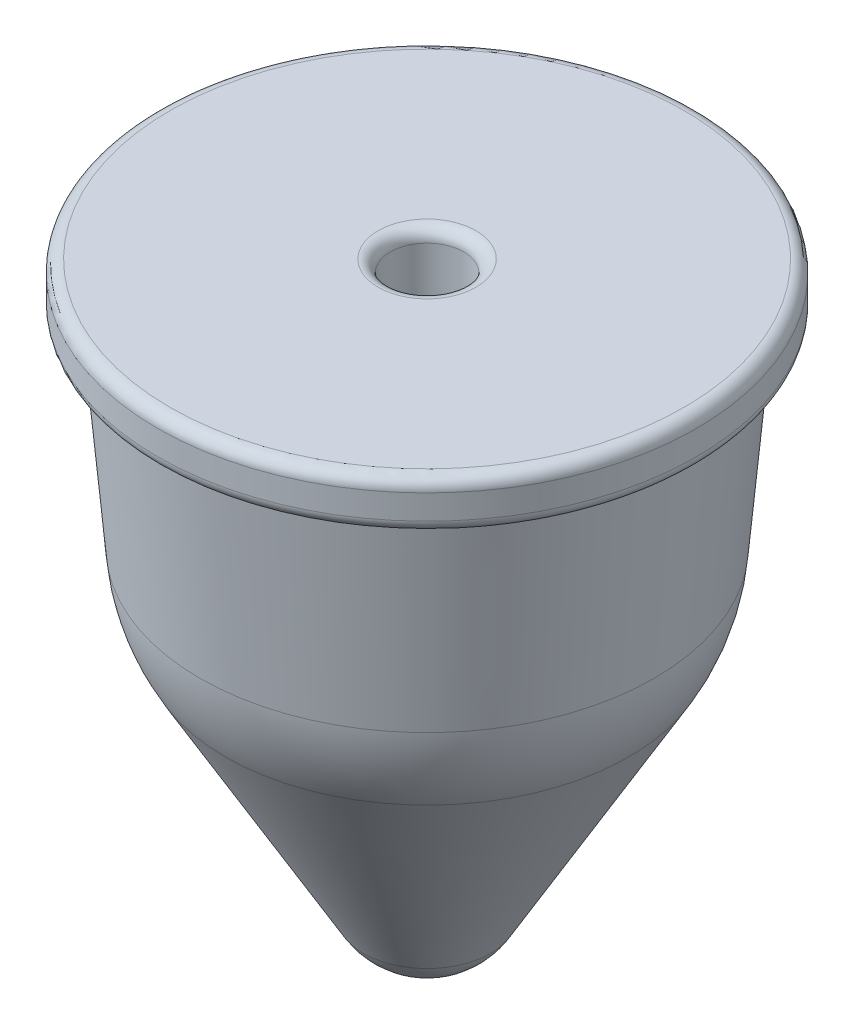
ISO-10303-21;
HEADER;
FILE_DESCRIPTION(('STEP AP214'),'2;1');
FILE_NAME('part.step','',(''),(''),'','','');
FILE_SCHEMA(('AUTOMOTIVE_DESIGN { 1 0 10303 214 1 1 1 1 }'));
ENDSEC;
DATA;
#1=APPLICATION_CONTEXT('core data for automotive mechanical design processes');
#2=APPLICATION_PROTOCOL_DEFINITION('international standard','automotive_design',2000,#1);
#3=PRODUCT_CONTEXT('',#1,'mechanical');
#4=PRODUCT('Part','Part','',(#3));
#5=PRODUCT_RELATED_PRODUCT_CATEGORY('part','',(#4));
#6=PRODUCT_DEFINITION_FORMATION('','',#4);
#7=PRODUCT_DEFINITION_CONTEXT('part definition',#1,'design');
#8=PRODUCT_DEFINITION('design','',#6,#7);
#9=PRODUCT_DEFINITION_SHAPE('','',#8);
#10=(LENGTH_UNIT() NAMED_UNIT(*) SI_UNIT(.MILLI.,.METRE.));
#11=(NAMED_UNIT(*) PLANE_ANGLE_UNIT() SI_UNIT($,.RADIAN.));
#12=(NAMED_UNIT(*) SI_UNIT($,.STERADIAN.) SOLID_ANGLE_UNIT());
#13=UNCERTAINTY_MEASURE_WITH_UNIT(LENGTH_MEASURE(1.E-05),#10,'distance_accuracy_value','');
#14=(GEOMETRIC_REPRESENTATION_CONTEXT(3) GLOBAL_UNCERTAINTY_ASSIGNED_CONTEXT((#13)) GLOBAL_UNIT_ASSIGNED_CONTEXT((#10,
#11,#12)) REPRESENTATION_CONTEXT('',''));
#15=CARTESIAN_POINT('',(0.,0.,0.));
#16=DIRECTION('',(0.,0.,1.));
#17=DIRECTION('',(1.,0.,0.));
#18=AXIS2_PLACEMENT_3D('',#15,#16,#17);
#19=CARTESIAN_POINT('',(0.,31.9265368447579,0.));
#20=DIRECTION('',(0.,-1.,0.));
#21=DIRECTION('',(-1.,0.,0.));
#22=AXIS2_PLACEMENT_3D('',#19,#20,#21);
#23=SPHERICAL_SURFACE('',#22,3.);
#24=CARTESIAN_POINT('',(0.,30.4265368447579,0.));
#25=DIRECTION('',(0.,-1.,0.));
#26=DIRECTION('',(0.,0.,-1.));
#27=AXIS2_PLACEMENT_3D('',#24,#25,#26);
#28=CIRCLE('',#27,2.59807621135332);
#29=CARTESIAN_POINT('',(0.,30.4265368447579,2.59807621135332));
#30=VERTEX_POINT('',#29);
#31=EDGE_CURVE('E135',#30,#30,#28,.T.);
#32=ORIENTED_EDGE('',*,*,#31,.T.);
#33=EDGE_LOOP('',(#32));
#34=FACE_BOUND('',#33,.T.);
#35=ADVANCED_FACE('F50',(#34),#23,.T.);
#36=CARTESIAN_POINT('',(0.,53.6927940025591,0.));
#37=DIRECTION('',(0.,1.,0.));
#38=DIRECTION('',(0.,0.,1.));
#39=AXIS2_PLACEMENT_3D('',#36,#37,#38);
#40=PLANE('',#39);
#41=CARTESIAN_POINT('',(0.,53.6927940025591,0.));
#42=DIRECTION('',(0.,1.,0.));
#43=DIRECTION('',(0.,0.,1.));
#44=AXIS2_PLACEMENT_3D('',#41,#42,#43);
#45=CIRCLE('',#44,2.);
#46=CARTESIAN_POINT('',(0.,53.6927940025591,2.));
#47=VERTEX_POINT('',#46);
#48=EDGE_CURVE('E11',#47,#47,#45,.F.);
#49=ORIENTED_EDGE('',*,*,#48,.T.);
#50=EDGE_LOOP('',(#49));
#51=FACE_BOUND('',#50,.T.);
#52=CARTESIAN_POINT('',(0.,53.6927940025591,0.));
#53=DIRECTION('',(0.,1.,0.));
#54=DIRECTION('',(0.,0.,1.));
#55=AXIS2_PLACEMENT_3D('',#52,#53,#54);
#56=CIRCLE('',#55,10.5);
#57=CARTESIAN_POINT('',(0.,53.6927940025591,10.5));
#58=VERTEX_POINT('',#57);
#59=EDGE_CURVE('E113',#58,#58,#56,.T.);
#60=ORIENTED_EDGE('',*,*,#59,.T.);
#61=EDGE_LOOP('',(#60));
#62=FACE_BOUND('',#61,.T.);
#63=ADVANCED_FACE('F76',(#51,#62),#40,.T.);
#64=CARTESIAN_POINT('',(0.,0.,0.));
#65=DIRECTION('',(0.,-1.,0.));
#66=DIRECTION('',(0.,0.,-1.));
#67=AXIS2_PLACEMENT_3D('',#64,#65,#66);
#68=CYLINDRICAL_SURFACE('',#67,11.);
#69=CARTESIAN_POINT('',(0.,52.1927940025591,0.));
#70=DIRECTION('',(0.,1.,0.));
#71=DIRECTION('',(0.,0.,1.));
#72=AXIS2_PLACEMENT_3D('',#69,#70,#71);
#73=CIRCLE('',#72,11.);
#74=CARTESIAN_POINT('',(0.,52.1927940025591,11.));
#75=VERTEX_POINT('',#74);
#76=EDGE_CURVE('E122',#75,#75,#73,.T.);
#77=ORIENTED_EDGE('',*,*,#76,.T.);
#78=EDGE_LOOP('',(#77));
#79=FACE_BOUND('',#78,.T.);
#80=CARTESIAN_POINT('',(0.,53.1927940025591,0.));
#81=DIRECTION('',(0.,1.,0.));
#82=DIRECTION('',(0.,0.,1.));
#83=AXIS2_PLACEMENT_3D('',#80,#81,#82);
#84=CIRCLE('',#83,11.);
#85=CARTESIAN_POINT('',(0.,53.1927940025591,11.));
#86=VERTEX_POINT('',#85);
#87=EDGE_CURVE('E139',#86,#86,#84,.F.);
#88=ORIENTED_EDGE('',*,*,#87,.T.);
#89=EDGE_LOOP('',(#88));
#90=FACE_BOUND('',#89,.T.);
#91=ADVANCED_FACE('F82',(#79,#90),#68,.T.);
#92=CARTESIAN_POINT('',(0.,51.6927940025591,0.));
#93=DIRECTION('',(0.,1.,0.));
#94=DIRECTION('',(0.,0.,1.));
#95=AXIS2_PLACEMENT_3D('',#92,#93,#94);
#96=PLANE('',#95);
#97=CARTESIAN_POINT('',(0.,51.6927940025591,0.));
#98=DIRECTION('',(0.,1.,0.));
#99=DIRECTION('',(0.,0.,1.));
#100=AXIS2_PLACEMENT_3D('',#97,#98,#99);
#101=CIRCLE('',#100,10.4543457494654);
#102=CARTESIAN_POINT('',(0.,51.6927940025591,10.4543457494654));
#103=VERTEX_POINT('',#102);
#104=EDGE_CURVE('E107',#103,#103,#101,.T.);
#105=ORIENTED_EDGE('',*,*,#104,.T.);
#106=EDGE_LOOP('',(#105));
#107=FACE_BOUND('',#106,.T.);
#108=CARTESIAN_POINT('',(0.,51.6927940025591,0.));
#109=DIRECTION('',(0.,1.,0.));
#110=DIRECTION('',(0.,0.,1.));
#111=AXIS2_PLACEMENT_3D('',#108,#109,#110);
#112=CIRCLE('',#111,10.5);
#113=CARTESIAN_POINT('',(0.,51.6927940025591,10.5));
#114=VERTEX_POINT('',#113);
#115=EDGE_CURVE('E136',#114,#114,#112,.F.);
#116=ORIENTED_EDGE('',*,*,#115,.T.);
#117=EDGE_LOOP('',(#116));
#118=FACE_BOUND('',#117,.T.);
#119=ADVANCED_FACE('F158',(#107,#118),#96,.F.);
#120=CARTESIAN_POINT('',(0.,51.6927940025591,0.));
#121=DIRECTION('',(0.,1.,0.));
#122=DIRECTION('',(0.,0.,1.));
#123=AXIS2_PLACEMENT_3D('',#120,#121,#122);
#124=CONICAL_SURFACE('',#123,9.99618016245665,0.08726646259971);
#125=CARTESIAN_POINT('',(0.,51.236371873933,0.));
#126=DIRECTION('',(0.,1.,0.));
#127=DIRECTION('',(0.,0.,1.));
#128=AXIS2_PLACEMENT_3D('',#125,#126,#127);
#129=CIRCLE('',#128,9.9562484004195);
#130=CARTESIAN_POINT('',(0.,51.236371873933,9.9562484004195));
#131=VERTEX_POINT('',#130);
#132=EDGE_CURVE('E110',#131,#131,#129,.F.);
#133=ORIENTED_EDGE('',*,*,#132,.T.);
#134=EDGE_LOOP('',(#133));
#135=FACE_BOUND('',#134,.T.);
#136=CARTESIAN_POINT('',(0.,43.4976554018028,0.));
#137=DIRECTION('',(0.,-1.,0.));
#138=DIRECTION('',(0.,0.,-1.));
#139=AXIS2_PLACEMENT_3D('',#136,#137,#138);
#140=CIRCLE('',#139,9.27919843886682);
#141=CARTESIAN_POINT('',(0.,43.4976554018028,-9.27919843886682));
#142=VERTEX_POINT('',#141);
#143=EDGE_CURVE('E140',#142,#142,#140,.F.);
#144=ORIENTED_EDGE('',*,*,#143,.T.);
#145=EDGE_LOOP('',(#144));
#146=FACE_BOUND('',#145,.T.);
#147=ADVANCED_FACE('F163',(#135,#146),#124,.T.);
#148=CARTESIAN_POINT('',(0.,41.7308470216417,0.));
#149=DIRECTION('',(0.,1.,0.));
#150=DIRECTION('',(0.,0.,1.));
#151=AXIS2_PLACEMENT_3D('',#148,#149,#150);
#152=CONICAL_SURFACE('',#151,9.12462273498013,0.523598775598293);
#153=CARTESIAN_POINT('',(0.,40.194901343784,0.));
#154=DIRECTION('',(0.,-1.,0.));
#155=DIRECTION('',(0.,0.,-1.));
#156=AXIS2_PLACEMENT_3D('',#153,#154,#155);
#157=CIRCLE('',#156,8.23784408440838);
#158=CARTESIAN_POINT('',(0.,40.194901343784,8.23784408440838));
#159=VERTEX_POINT('',#158);
#160=EDGE_CURVE('E145',#159,#159,#157,.T.);
#161=CARTESIAN_POINT('',(0.,40.194901343784,8.23784408440838));
#162=CARTESIAN_POINT('',(0.,40.0931475469192,8.17909650239739));
#163=CARTESIAN_POINT('',(0.,39.9913937500543,8.12034892038641));
#164=CARTESIAN_POINT('',(0.,39.7878861563246,8.00285375636442));
#165=CARTESIAN_POINT('',(0.,39.6861323594597,7.94410617435343));
#166=CARTESIAN_POINT('',(0.,39.48262476573,7.82661101033145));
#167=CARTESIAN_POINT('',(0.,39.3808709688652,7.76786342832046));
#168=CARTESIAN_POINT('',(0.,39.1773633751355,7.65036826429848));
#169=CARTESIAN_POINT('',(0.,39.0756095782706,7.59162068228749));
#170=CARTESIAN_POINT('',(0.,38.8721019845409,7.47412551826551));
#171=CARTESIAN_POINT('',(0.,38.770348187676,7.41537793625452));
#172=CARTESIAN_POINT('',(0.,38.5668405939463,7.29788277223254));
#173=CARTESIAN_POINT('',(0.,38.4650867970815,7.23913519022155));
#174=CARTESIAN_POINT('',(0.,38.2615792033518,7.12164002619957));
#175=CARTESIAN_POINT('',(0.,38.1598254064869,7.06289244418858));
#176=CARTESIAN_POINT('',(0.,37.9563178127572,6.9453972801666));
#177=CARTESIAN_POINT('',(0.,37.8545640158923,6.88664969815561));
#178=CARTESIAN_POINT('',(0.,37.6510564221626,6.76915453413363));
#179=CARTESIAN_POINT('',(0.,37.5493026252978,6.71040695212264));
#180=CARTESIAN_POINT('',(0.,37.3457950315681,6.59291178810066));
#181=CARTESIAN_POINT('',(0.,37.2440412347032,6.53416420608967));
#182=CARTESIAN_POINT('',(0.,37.0405336409735,6.41666904206769));
#183=CARTESIAN_POINT('',(0.,36.9387798441086,6.3579214600567));
#184=CARTESIAN_POINT('',(0.,36.7352722503789,6.24042629603472));
#185=CARTESIAN_POINT('',(0.,36.6335184535141,6.18167871402373));
#186=CARTESIAN_POINT('',(0.,36.4300108597844,6.06418355000175));
#187=CARTESIAN_POINT('',(0.,36.3282570629195,6.00543596799076));
#188=CARTESIAN_POINT('',(0.,36.1247494691898,5.88794080396878));
#189=CARTESIAN_POINT('',(0.,36.0229956723249,5.82919322195779));
#190=CARTESIAN_POINT('',(0.,35.8194880785952,5.7116980579358));
#191=CARTESIAN_POINT('',(0.,35.7177342817304,5.65295047592481));
#192=CARTESIAN_POINT('',(0.,35.5142266880007,5.53545531190283));
#193=CARTESIAN_POINT('',(0.,35.4124728911358,5.47670772989184));
#194=CARTESIAN_POINT('',(0.,35.2089652974061,5.35921256586986));
#195=CARTESIAN_POINT('',(0.,35.1072115005412,5.30046498385887));
#196=CARTESIAN_POINT('',(0.,34.9037039068115,5.18296981983689));
#197=CARTESIAN_POINT('',(0.,34.8019501099467,5.1242222378259));
#198=CARTESIAN_POINT('',(0.,34.598442516217,5.00672707380392));
#199=CARTESIAN_POINT('',(0.,34.4966887193521,4.94797949179293));
#200=CARTESIAN_POINT('',(0.,34.2931811256224,4.83048432777095));
#201=CARTESIAN_POINT('',(0.,34.1914273287575,4.77173674575996));
#202=CARTESIAN_POINT('',(0.,33.9879197350278,4.65424158173798));
#203=CARTESIAN_POINT('',(0.,33.886165938163,4.59549399972699));
#204=CARTESIAN_POINT('',(0.,33.6826583444333,4.47799883570501));
#205=CARTESIAN_POINT('',(0.,33.5809045475684,4.41925125369402));
#206=CARTESIAN_POINT('',(0.,33.3773969538387,4.30175608967204));
#207=CARTESIAN_POINT('',(0.,33.2756431569738,4.24300850766105));
#208=CARTESIAN_POINT('',(0.,33.0721355632441,4.12551334363907));
#209=CARTESIAN_POINT('',(0.,32.9703817663793,4.06676576162808));
#210=CARTESIAN_POINT('',(0.,32.7668741726496,3.9492705976061));
#211=CARTESIAN_POINT('',(0.,32.6651203757847,3.89052301559511));
#212=CARTESIAN_POINT('',(0.,32.461612782055,3.77302785157313));
#213=CARTESIAN_POINT('',(0.,32.3598589851901,3.71428026956214));
#214=CARTESIAN_POINT('',(0.,32.1563513914604,3.59678510554016));
#215=CARTESIAN_POINT('',(0.,32.0545975945956,3.53803752352917));
#216=CARTESIAN_POINT('',(0.,31.8510900008659,3.42054235950719));
#217=CARTESIAN_POINT('',(0.,31.749336204001,3.3617947774962));
#218=CARTESIAN_POINT('',(0.,31.5458286102713,3.24429961347421));
#219=CARTESIAN_POINT('',(0.,31.4440748134064,3.18555203146323));
#220=CARTESIAN_POINT('',(0.,31.2405672196767,3.06805686744124));
#221=CARTESIAN_POINT('',(0.,31.1388134228119,3.00930928543025));
#222=CARTESIAN_POINT('',(0.,30.9353058290821,2.89181412140827));
#223=CARTESIAN_POINT('',(0.,30.8335520322173,2.83306653939728));
#224=CARTESIAN_POINT('',(0.,30.6300444384876,2.7155713753753));
#225=CARTESIAN_POINT('',(0.,30.5282906416227,2.65682379336431));
#226=CARTESIAN_POINT('',(0.,30.4265368447579,2.59807621135332));
#227=B_SPLINE_CURVE_WITH_KNOTS('',3,(#161,#162,#163,#164,#165,#166,#167,#168,#169,#170,#171,
#172,#173,#174,#175,#176,#177,#178,#179,#180,#181,#182,#183,#184,#185,#186,#187,#188,#189,#190,
#191,#192,#193,#194,#195,#196,#197,#198,#199,#200,#201,#202,#203,#204,#205,#206,#207,#208,#209,
#210,#211,#212,#213,#214,#215,#216,#217,#218,#219,#220,#221,#222,#223,#224,#225,#226),
.UNSPECIFIED.,.F.,.F.,(4,2,2,2,2,2,2,2,2,2,2,2,2,2,2,2,2,2,2,2,2,2,2,2,2,2,2,2,2,2,2,2,4),(0.,
0.352485492065942,0.704970984131885,1.05745647619783,1.40994196826378,1.76242746032972,
2.11491295239567,2.46739844446161,2.81988393652755,3.1723694285935,3.52485492065944,
3.87734041272539,4.22982590479134,4.58231139685728,4.93479688892323,5.28728238098917,
5.63976787305512,5.99225336512106,6.344738857187,6.69722434925295,7.04970984131889,
7.40219533338484,7.75468082545078,8.10716631751673,8.45965180958267,8.81213730164862,
9.16462279371456,9.5171082857805,9.86959377784645,10.2220792699124,10.5745647619783,
10.9270502540443,11.2795357461102),.UNSPECIFIED.);
#228=EDGE_CURVE('BSEAM92',#159,#30,#227,.T.);
#229=ORIENTED_EDGE('',*,*,#160,.T.);
#230=ORIENTED_EDGE('',*,*,#31,.F.);
#231=ORIENTED_EDGE('',*,*,#228,.T.);
#232=ORIENTED_EDGE('',*,*,#228,.F.);
#233=EDGE_LOOP('',(#229,#231,#230,#232));
#234=FACE_BOUND('',#233,.T.);
#235=ADVANCED_FACE('F92',(#234),#152,.T.);
#236=CARTESIAN_POINT('',(0.,44.194901343784,0.));
#237=DIRECTION('',(0.,1.,0.));
#238=DIRECTION('',(0.,0.,1.));
#239=AXIS2_PLACEMENT_3D('',#236,#237,#238);
#240=DEGENERATE_TOROIDAL_SURFACE('',#239,1.30964085413285,8.,.T.);
#241=ORIENTED_EDGE('',*,*,#143,.F.);
#242=EDGE_LOOP('',(#241));
#243=FACE_BOUND('',#242,.T.);
#244=ORIENTED_EDGE('',*,*,#160,.F.);
#245=EDGE_LOOP('',(#244));
#246=FACE_BOUND('',#245,.T.);
#247=ADVANCED_FACE('F88',(#243,#246),#240,.T.);
#248=CARTESIAN_POINT('',(0.,52.1927940025591,0.));
#249=DIRECTION('',(0.,1.,0.));
#250=DIRECTION('',(0.,0.,1.));
#251=AXIS2_PLACEMENT_3D('',#248,#249,#250);
#252=TOROIDAL_SURFACE('',#251,10.5,0.5);
#253=ORIENTED_EDGE('',*,*,#76,.F.);
#254=EDGE_LOOP('',(#253));
#255=FACE_BOUND('',#254,.T.);
#256=ORIENTED_EDGE('',*,*,#115,.F.);
#257=EDGE_LOOP('',(#256));
#258=FACE_BOUND('',#257,.T.);
#259=ADVANCED_FACE('F91',(#255,#258),#252,.T.);
#260=CARTESIAN_POINT('',(0.,53.1927940025591,0.));
#261=DIRECTION('',(0.,1.,0.));
#262=DIRECTION('',(0.,0.,1.));
#263=AXIS2_PLACEMENT_3D('',#260,#261,#262);
#264=TOROIDAL_SURFACE('',#263,10.5,0.5);
#265=ORIENTED_EDGE('',*,*,#59,.F.);
#266=EDGE_LOOP('',(#265));
#267=FACE_BOUND('',#266,.T.);
#268=ORIENTED_EDGE('',*,*,#87,.F.);
#269=EDGE_LOOP('',(#268));
#270=FACE_BOUND('',#269,.T.);
#271=ADVANCED_FACE('F96',(#267,#270),#264,.T.);
#272=CARTESIAN_POINT('',(0.,51.1927940025591,0.));
#273=DIRECTION('',(0.,1.,0.));
#274=DIRECTION('',(0.,0.,1.));
#275=AXIS2_PLACEMENT_3D('',#272,#273,#274);
#276=TOROIDAL_SURFACE('',#275,10.4543457494654,0.5);
#277=ORIENTED_EDGE('',*,*,#104,.F.);
#278=EDGE_LOOP('',(#277));
#279=FACE_BOUND('',#278,.T.);
#280=ORIENTED_EDGE('',*,*,#132,.F.);
#281=EDGE_LOOP('',(#280));
#282=FACE_BOUND('',#281,.T.);
#283=ADVANCED_FACE('F70',(#279,#282),#276,.F.);
#284=CARTESIAN_POINT('',(0.,47.6927940025592,0.));
#285=DIRECTION('',(0.,1.,0.));
#286=DIRECTION('',(0.,0.,1.));
#287=AXIS2_PLACEMENT_3D('',#284,#285,#286);
#288=CYLINDRICAL_SURFACE('',#287,1.5);
#289=CARTESIAN_POINT('',(0.,53.1927940025591,0.));
#290=DIRECTION('',(0.,1.,0.));
#291=DIRECTION('',(0.,0.,1.));
#292=AXIS2_PLACEMENT_3D('',#289,#290,#291);
#293=CIRCLE('',#292,1.5);
#294=CARTESIAN_POINT('',(0.,53.1927940025591,1.5));
#295=VERTEX_POINT('',#294);
#296=EDGE_CURVE('E58',#295,#295,#293,.T.);
#297=ORIENTED_EDGE('',*,*,#296,.T.);
#298=EDGE_LOOP('',(#297));
#299=FACE_BOUND('',#298,.T.);
#300=CARTESIAN_POINT('',(0.,49.1927940025592,0.));
#301=DIRECTION('',(0.,1.,0.));
#302=DIRECTION('',(0.,0.,1.));
#303=AXIS2_PLACEMENT_3D('',#300,#301,#302);
#304=CIRCLE('',#303,1.5);
#305=CARTESIAN_POINT('',(0.,49.1927940025592,1.5));
#306=VERTEX_POINT('',#305);
#307=EDGE_CURVE('E118',#306,#306,#304,.F.);
#308=ORIENTED_EDGE('',*,*,#307,.T.);
#309=EDGE_LOOP('',(#308));
#310=FACE_BOUND('',#309,.T.);
#311=ADVANCED_FACE('F63',(#299,#310),#288,.F.);
#312=CARTESIAN_POINT('',(0.,49.1927940025592,0.));
#313=DIRECTION('',(0.,1.,0.));
#314=DIRECTION('',(0.,0.,1.));
#315=AXIS2_PLACEMENT_3D('',#312,#313,#314);
#316=CONICAL_SURFACE('',#315,1.50000000000002,0.785398163397451);
#317=ORIENTED_EDGE('',*,*,#307,.F.);
#318=EDGE_LOOP('',(#317));
#319=FACE_BOUND('',#318,.T.);
#320=CARTESIAN_POINT('',(0.,47.6927940025592,0.));
#321=VERTEX_POINT('',#320);
#322=VERTEX_LOOP('',#321);
#323=FACE_BOUND('',#322,.T.);
#324=ADVANCED_FACE('F61',(#319,#323),#316,.F.);
#325=CARTESIAN_POINT('',(0.,53.1927940025591,0.));
#326=DIRECTION('',(0.,1.,0.));
#327=DIRECTION('',(0.,0.,1.));
#328=AXIS2_PLACEMENT_3D('',#325,#326,#327);
#329=TOROIDAL_SURFACE('',#328,2.,0.5);
#330=ORIENTED_EDGE('',*,*,#48,.F.);
#331=EDGE_LOOP('',(#330));
#332=FACE_BOUND('',#331,.T.);
#333=ORIENTED_EDGE('',*,*,#296,.F.);
#334=EDGE_LOOP('',(#333));
#335=FACE_BOUND('',#334,.T.);
#336=ADVANCED_FACE('F52',(#332,#335),#329,.T.);
#337=CLOSED_SHELL('',(#35,#63,#91,#119,#147,#235,#247,#259,#271,#283,#311,#324,#336));
#338=MANIFOLD_SOLID_BREP('B2',#337);
#339=ADVANCED_BREP_SHAPE_REPRESENTATION('',(#18,#338),#14);
#340=SHAPE_DEFINITION_REPRESENTATION(#9,#339);
ENDSEC;
END-ISO-10303-21;
